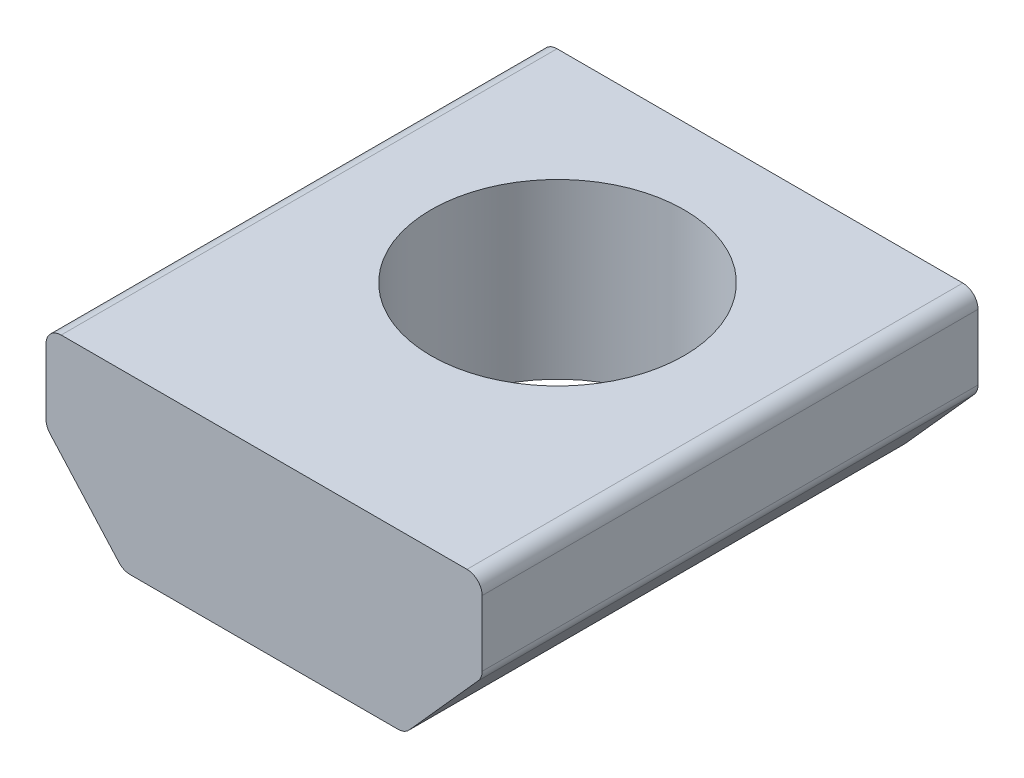
ISO-10303-21;
HEADER;
FILE_DESCRIPTION(('STEP AP214'),'2;1');
FILE_NAME('part.step','',(''),(''),'','','');
FILE_SCHEMA(('AUTOMOTIVE_DESIGN { 1 0 10303 214 1 1 1 1 }'));
ENDSEC;
DATA;
#1=APPLICATION_CONTEXT('core data for automotive mechanical design processes');
#2=APPLICATION_PROTOCOL_DEFINITION('international standard','automotive_design',2000,#1);
#3=PRODUCT_CONTEXT('',#1,'mechanical');
#4=PRODUCT('Part','Part','',(#3));
#5=PRODUCT_RELATED_PRODUCT_CATEGORY('part','',(#4));
#6=PRODUCT_DEFINITION_FORMATION('','',#4);
#7=PRODUCT_DEFINITION_CONTEXT('part definition',#1,'design');
#8=PRODUCT_DEFINITION('design','',#6,#7);
#9=PRODUCT_DEFINITION_SHAPE('','',#8);
#10=(LENGTH_UNIT() NAMED_UNIT(*) SI_UNIT(.MILLI.,.METRE.));
#11=(NAMED_UNIT(*) PLANE_ANGLE_UNIT() SI_UNIT($,.RADIAN.));
#12=(NAMED_UNIT(*) SI_UNIT($,.STERADIAN.) SOLID_ANGLE_UNIT());
#13=UNCERTAINTY_MEASURE_WITH_UNIT(LENGTH_MEASURE(1.E-05),#10,'distance_accuracy_value','');
#14=(GEOMETRIC_REPRESENTATION_CONTEXT(3) GLOBAL_UNCERTAINTY_ASSIGNED_CONTEXT((#13)) GLOBAL_UNIT_ASSIGNED_CONTEXT((#10,
#11,#12)) REPRESENTATION_CONTEXT('',''));
#15=CARTESIAN_POINT('',(0.,0.,0.));
#16=DIRECTION('',(0.,0.,1.));
#17=DIRECTION('',(1.,0.,0.));
#18=AXIS2_PLACEMENT_3D('',#15,#16,#17);
#19=CARTESIAN_POINT('',(5.09269999999992,-2.02613340156511,12.446));
#20=DIRECTION('',(0.,0.,-1.));
#21=DIRECTION('',(-1.,0.,0.));
#22=AXIS2_PLACEMENT_3D('',#19,#20,#21);
#23=CYLINDRICAL_SURFACE('',#22,0.381000000000009);
#24=CARTESIAN_POINT('',(5.09269999999992,-2.02613340156511,0.));
#25=DIRECTION('',(0.,0.,1.));
#26=DIRECTION('',(1.,0.,0.));
#27=AXIS2_PLACEMENT_3D('',#24,#25,#26);
#28=CIRCLE('',#27,0.381000000000009);
#29=CARTESIAN_POINT('',(5.37663694045301,-2.28018224302311,0.));
#30=VERTEX_POINT('',#29);
#31=CARTESIAN_POINT('',(5.47369999999993,-2.02613340156511,0.));
#32=VERTEX_POINT('',#31);
#33=EDGE_CURVE('E156',#30,#32,#28,.T.);
#34=ORIENTED_EDGE('',*,*,#33,.T.);
#35=DIRECTION('',(0.,0.,-1.));
#36=VECTOR('',#35,1.);
#37=CARTESIAN_POINT('',(5.47369999999993,-2.02613340156511,12.446));
#38=LINE('',#37,#36);
#39=CARTESIAN_POINT('',(5.47369999999993,-2.02613340156511,12.446));
#40=VERTEX_POINT('',#39);
#41=EDGE_CURVE('E11',#40,#32,#38,.T.);
#42=ORIENTED_EDGE('',*,*,#41,.F.);
#43=CARTESIAN_POINT('',(5.09269999999992,-2.02613340156511,12.446));
#44=DIRECTION('',(0.,0.,1.));
#45=DIRECTION('',(1.,0.,0.));
#46=AXIS2_PLACEMENT_3D('',#43,#44,#45);
#47=CIRCLE('',#46,0.381000000000009);
#48=CARTESIAN_POINT('',(5.37663694045301,-2.28018224302311,12.446));
#49=VERTEX_POINT('',#48);
#50=EDGE_CURVE('E178',#49,#40,#47,.T.);
#51=ORIENTED_EDGE('',*,*,#50,.F.);
#52=DIRECTION('',(0.,0.,-1.));
#53=VECTOR('',#52,1.);
#54=CARTESIAN_POINT('',(5.37663694045301,-2.28018224302311,12.446));
#55=LINE('',#54,#53);
#56=EDGE_CURVE('E152',#49,#30,#55,.T.);
#57=ORIENTED_EDGE('',*,*,#56,.T.);
#58=EDGE_LOOP('',(#34,#42,#51,#57));
#59=FACE_BOUND('',#58,.T.);
#60=ADVANCED_FACE('F35',(#59),#23,.T.);
#61=CARTESIAN_POINT('',(5.47369999999993,-0.38100000000002,12.446));
#62=DIRECTION('',(-1.,0.,0.));
#63=DIRECTION('',(0.,0.,1.));
#64=AXIS2_PLACEMENT_3D('',#61,#62,#63);
#65=PLANE('',#64);
#66=DIRECTION('',(0.,1.,0.));
#67=VECTOR('',#66,1.);
#68=CARTESIAN_POINT('',(5.47369999999993,-0.38100000000002,0.));
#69=LINE('',#68,#67);
#70=CARTESIAN_POINT('',(5.47369999999993,-0.38100000000002,0.));
#71=VERTEX_POINT('',#70);
#72=EDGE_CURVE('E159',#32,#71,#69,.T.);
#73=ORIENTED_EDGE('',*,*,#72,.T.);
#74=DIRECTION('',(0.,0.,-1.));
#75=VECTOR('',#74,1.);
#76=CARTESIAN_POINT('',(5.47369999999993,-0.38100000000002,12.446));
#77=LINE('',#76,#75);
#78=CARTESIAN_POINT('',(5.47369999999993,-0.38100000000002,12.446));
#79=VERTEX_POINT('',#78);
#80=EDGE_CURVE('E44',#79,#71,#77,.T.);
#81=ORIENTED_EDGE('',*,*,#80,.F.);
#82=DIRECTION('',(0.,1.,0.));
#83=VECTOR('',#82,1.);
#84=CARTESIAN_POINT('',(5.47369999999993,-0.38100000000002,12.446));
#85=LINE('',#84,#83);
#86=EDGE_CURVE('E107',#40,#79,#85,.T.);
#87=ORIENTED_EDGE('',*,*,#86,.F.);
#88=ORIENTED_EDGE('',*,*,#41,.T.);
#89=EDGE_LOOP('',(#73,#81,#87,#88));
#90=FACE_BOUND('',#89,.T.);
#91=ADVANCED_FACE('F257',(#90),#65,.F.);
#92=CARTESIAN_POINT('',(5.09269999999991,-0.38100000000002,12.446));
#93=DIRECTION('',(0.,0.,-1.));
#94=DIRECTION('',(-1.,0.,0.));
#95=AXIS2_PLACEMENT_3D('',#92,#93,#94);
#96=CYLINDRICAL_SURFACE('',#95,0.38100000000002);
#97=CARTESIAN_POINT('',(5.09269999999991,-0.38100000000002,0.));
#98=DIRECTION('',(0.,0.,1.));
#99=DIRECTION('',(1.,0.,0.));
#100=AXIS2_PLACEMENT_3D('',#97,#98,#99);
#101=CIRCLE('',#100,0.38100000000002);
#102=CARTESIAN_POINT('',(5.09269999999998,0.,0.));
#103=VERTEX_POINT('',#102);
#104=EDGE_CURVE('E161',#71,#103,#101,.T.);
#105=ORIENTED_EDGE('',*,*,#104,.T.);
#106=DIRECTION('',(0.,0.,-1.));
#107=VECTOR('',#106,1.);
#108=CARTESIAN_POINT('',(5.09269999999998,0.,12.446));
#109=LINE('',#108,#107);
#110=CARTESIAN_POINT('',(5.09269999999998,0.,12.446));
#111=VERTEX_POINT('',#110);
#112=EDGE_CURVE('E197',#111,#103,#109,.T.);
#113=ORIENTED_EDGE('',*,*,#112,.F.);
#114=CARTESIAN_POINT('',(5.09269999999991,-0.38100000000002,12.446));
#115=DIRECTION('',(0.,0.,1.));
#116=DIRECTION('',(1.,0.,0.));
#117=AXIS2_PLACEMENT_3D('',#114,#115,#116);
#118=CIRCLE('',#117,0.38100000000002);
#119=EDGE_CURVE('E206',#79,#111,#118,.T.);
#120=ORIENTED_EDGE('',*,*,#119,.F.);
#121=ORIENTED_EDGE('',*,*,#80,.T.);
#122=EDGE_LOOP('',(#105,#113,#120,#121));
#123=FACE_BOUND('',#122,.T.);
#124=ADVANCED_FACE('F204',(#123),#96,.T.);
#125=CARTESIAN_POINT('',(-5.09269999999998,0.,12.446));
#126=DIRECTION('',(0.,-1.,0.));
#127=DIRECTION('',(0.,0.,-1.));
#128=AXIS2_PLACEMENT_3D('',#125,#126,#127);
#129=PLANE('',#128);
#130=CARTESIAN_POINT('',(0.,0.,5.08));
#131=DIRECTION('',(0.,1.,0.));
#132=DIRECTION('',(-1.,0.,0.));
#133=AXIS2_PLACEMENT_3D('',#130,#131,#132);
#134=CIRCLE('',#133,3.175);
#135=CARTESIAN_POINT('',(-3.175,0.,5.08));
#136=VERTEX_POINT('',#135);
#137=EDGE_CURVE('E290',#136,#136,#134,.T.);
#138=ORIENTED_EDGE('',*,*,#137,.F.);
#139=EDGE_LOOP('',(#138));
#140=FACE_BOUND('',#139,.T.);
#141=DIRECTION('',(-1.,0.,0.));
#142=VECTOR('',#141,1.);
#143=CARTESIAN_POINT('',(-5.09269999999998,0.,0.));
#144=LINE('',#143,#142);
#145=CARTESIAN_POINT('',(-5.09269999999998,0.,0.));
#146=VERTEX_POINT('',#145);
#147=EDGE_CURVE('E163',#103,#146,#144,.T.);
#148=ORIENTED_EDGE('',*,*,#147,.T.);
#149=DIRECTION('',(0.,0.,-1.));
#150=VECTOR('',#149,1.);
#151=CARTESIAN_POINT('',(-5.09269999999998,0.,12.446));
#152=LINE('',#151,#150);
#153=CARTESIAN_POINT('',(-5.09269999999998,0.,12.446));
#154=VERTEX_POINT('',#153);
#155=EDGE_CURVE('E194',#154,#146,#152,.T.);
#156=ORIENTED_EDGE('',*,*,#155,.F.);
#157=DIRECTION('',(-1.,0.,0.));
#158=VECTOR('',#157,1.);
#159=CARTESIAN_POINT('',(-5.09269999999998,0.,12.446));
#160=LINE('',#159,#158);
#161=EDGE_CURVE('E224',#111,#154,#160,.T.);
#162=ORIENTED_EDGE('',*,*,#161,.F.);
#163=ORIENTED_EDGE('',*,*,#112,.T.);
#164=EDGE_LOOP('',(#148,#156,#162,#163));
#165=FACE_BOUND('',#164,.T.);
#166=ADVANCED_FACE('F215',(#140,#165),#129,.F.);
#167=CARTESIAN_POINT('',(-5.09269999999998,-0.381000000000006,12.446));
#168=DIRECTION('',(0.,0.,-1.));
#169=DIRECTION('',(-1.,0.,0.));
#170=AXIS2_PLACEMENT_3D('',#167,#168,#169);
#171=CYLINDRICAL_SURFACE('',#170,0.381000000000013);
#172=CARTESIAN_POINT('',(-5.09269999999998,-0.381000000000006,0.));
#173=DIRECTION('',(0.,0.,1.));
#174=DIRECTION('',(1.,0.,0.));
#175=AXIS2_PLACEMENT_3D('',#172,#173,#174);
#176=CIRCLE('',#175,0.381000000000013);
#177=CARTESIAN_POINT('',(-5.47369999999999,-0.381000000000006,0.));
#178=VERTEX_POINT('',#177);
#179=EDGE_CURVE('E165',#146,#178,#176,.T.);
#180=ORIENTED_EDGE('',*,*,#179,.T.);
#181=DIRECTION('',(0.,0.,-1.));
#182=VECTOR('',#181,1.);
#183=CARTESIAN_POINT('',(-5.47369999999999,-0.381000000000006,12.446));
#184=LINE('',#183,#182);
#185=CARTESIAN_POINT('',(-5.47369999999999,-0.381000000000006,12.446));
#186=VERTEX_POINT('',#185);
#187=EDGE_CURVE('E191',#186,#178,#184,.T.);
#188=ORIENTED_EDGE('',*,*,#187,.F.);
#189=CARTESIAN_POINT('',(-5.09269999999998,-0.381000000000006,12.446));
#190=DIRECTION('',(0.,0.,1.));
#191=DIRECTION('',(1.,0.,0.));
#192=AXIS2_PLACEMENT_3D('',#189,#190,#191);
#193=CIRCLE('',#192,0.381000000000013);
#194=EDGE_CURVE('E221',#154,#186,#193,.T.);
#195=ORIENTED_EDGE('',*,*,#194,.F.);
#196=ORIENTED_EDGE('',*,*,#155,.T.);
#197=EDGE_LOOP('',(#180,#188,#195,#196));
#198=FACE_BOUND('',#197,.T.);
#199=ADVANCED_FACE('F219',(#198),#171,.T.);
#200=CARTESIAN_POINT('',(-5.4737,-0.381000000000006,12.446));
#201=DIRECTION('',(1.,0.,0.));
#202=DIRECTION('',(0.,0.,-1.));
#203=AXIS2_PLACEMENT_3D('',#200,#201,#202);
#204=PLANE('',#203);
#205=DIRECTION('',(0.,-1.,0.));
#206=VECTOR('',#205,1.);
#207=CARTESIAN_POINT('',(-5.4737,-0.381000000000006,0.));
#208=LINE('',#207,#206);
#209=CARTESIAN_POINT('',(-5.4737,-2.0261334015651,0.));
#210=VERTEX_POINT('',#209);
#211=EDGE_CURVE('E167',#178,#210,#208,.T.);
#212=ORIENTED_EDGE('',*,*,#211,.T.);
#213=DIRECTION('',(0.,0.,-1.));
#214=VECTOR('',#213,1.);
#215=CARTESIAN_POINT('',(-5.4737,-2.0261334015651,12.446));
#216=LINE('',#215,#214);
#217=CARTESIAN_POINT('',(-5.4737,-2.0261334015651,12.446));
#218=VERTEX_POINT('',#217);
#219=EDGE_CURVE('E188',#218,#210,#216,.T.);
#220=ORIENTED_EDGE('',*,*,#219,.F.);
#221=DIRECTION('',(0.,-1.,0.));
#222=VECTOR('',#221,1.);
#223=CARTESIAN_POINT('',(-5.4737,-0.381000000000006,12.446));
#224=LINE('',#223,#222);
#225=EDGE_CURVE('E223',#186,#218,#224,.T.);
#226=ORIENTED_EDGE('',*,*,#225,.F.);
#227=ORIENTED_EDGE('',*,*,#187,.T.);
#228=EDGE_LOOP('',(#212,#220,#226,#227));
#229=FACE_BOUND('',#228,.T.);
#230=ADVANCED_FACE('F271',(#229),#204,.F.);
#231=CARTESIAN_POINT('',(-5.09269999999999,-2.0261334015651,12.446));
#232=DIRECTION('',(0.,0.,-1.));
#233=DIRECTION('',(-1.,0.,0.));
#234=AXIS2_PLACEMENT_3D('',#231,#232,#233);
#235=CYLINDRICAL_SURFACE('',#234,0.381000000000004);
#236=CARTESIAN_POINT('',(-5.09269999999999,-2.0261334015651,0.));
#237=DIRECTION('',(0.,0.,1.));
#238=DIRECTION('',(1.,0.,0.));
#239=AXIS2_PLACEMENT_3D('',#236,#237,#238);
#240=CIRCLE('',#239,0.381000000000004);
#241=CARTESIAN_POINT('',(-5.37663694045307,-2.28018224302309,0.));
#242=VERTEX_POINT('',#241);
#243=EDGE_CURVE('E169',#210,#242,#240,.T.);
#244=ORIENTED_EDGE('',*,*,#243,.T.);
#245=DIRECTION('',(0.,0.,-1.));
#246=VECTOR('',#245,1.);
#247=CARTESIAN_POINT('',(-5.37663694045307,-2.28018224302309,12.446));
#248=LINE('',#247,#246);
#249=CARTESIAN_POINT('',(-5.37663694045307,-2.28018224302309,12.446));
#250=VERTEX_POINT('',#249);
#251=EDGE_CURVE('E185',#250,#242,#248,.T.);
#252=ORIENTED_EDGE('',*,*,#251,.F.);
#253=CARTESIAN_POINT('',(-5.09269999999999,-2.0261334015651,12.446));
#254=DIRECTION('',(0.,0.,1.));
#255=DIRECTION('',(1.,0.,0.));
#256=AXIS2_PLACEMENT_3D('',#253,#254,#255);
#257=CIRCLE('',#256,0.381000000000004);
#258=EDGE_CURVE('E226',#218,#250,#257,.T.);
#259=ORIENTED_EDGE('',*,*,#258,.F.);
#260=ORIENTED_EDGE('',*,*,#219,.T.);
#261=EDGE_LOOP('',(#244,#252,#259,#260));
#262=FACE_BOUND('',#261,.T.);
#263=ADVANCED_FACE('F274',(#262),#235,.T.);
#264=CARTESIAN_POINT('',(-3.64418787869555,-4.21644884145803,12.446));
#265=DIRECTION('',(0.74524131352511,0.666794859469813,0.));
#266=DIRECTION('',(-0.666794859469813,0.745241313525111,0.));
#267=AXIS2_PLACEMENT_3D('',#264,#265,#266);
#268=PLANE('',#267);
#269=DIRECTION('',(0.666794859469813,-0.745241313525111,0.));
#270=VECTOR('',#269,1.);
#271=CARTESIAN_POINT('',(-3.64418787869555,-4.21644884145803,0.));
#272=LINE('',#271,#270);
#273=CARTESIAN_POINT('',(-3.64418787869555,-4.21644884145803,0.));
#274=VERTEX_POINT('',#273);
#275=EDGE_CURVE('E171',#242,#274,#272,.T.);
#276=ORIENTED_EDGE('',*,*,#275,.T.);
#277=DIRECTION('',(0.,0.,-1.));
#278=VECTOR('',#277,1.);
#279=CARTESIAN_POINT('',(-3.64418787869555,-4.21644884145803,12.446));
#280=LINE('',#279,#278);
#281=CARTESIAN_POINT('',(-3.64418787869555,-4.21644884145803,12.446));
#282=VERTEX_POINT('',#281);
#283=EDGE_CURVE('E182',#282,#274,#280,.T.);
#284=ORIENTED_EDGE('',*,*,#283,.F.);
#285=DIRECTION('',(0.666794859469813,-0.745241313525111,0.));
#286=VECTOR('',#285,1.);
#287=CARTESIAN_POINT('',(-3.64418787869555,-4.21644884145803,12.446));
#288=LINE('',#287,#286);
#289=EDGE_CURVE('E232',#250,#282,#288,.T.);
#290=ORIENTED_EDGE('',*,*,#289,.F.);
#291=ORIENTED_EDGE('',*,*,#251,.T.);
#292=EDGE_LOOP('',(#276,#284,#290,#291));
#293=FACE_BOUND('',#292,.T.);
#294=ADVANCED_FACE('F238',(#293),#268,.F.);
#295=CARTESIAN_POINT('',(-3.36025093824249,-3.96240000000005,12.446));
#296=DIRECTION('',(0.,0.,-1.));
#297=DIRECTION('',(-1.,0.,0.));
#298=AXIS2_PLACEMENT_3D('',#295,#296,#297);
#299=CYLINDRICAL_SURFACE('',#298,0.380999999999981);
#300=CARTESIAN_POINT('',(-3.36025093824249,-3.96240000000005,0.));
#301=DIRECTION('',(0.,0.,1.));
#302=DIRECTION('',(1.,0.,0.));
#303=AXIS2_PLACEMENT_3D('',#300,#301,#302);
#304=CIRCLE('',#303,0.380999999999981);
#305=CARTESIAN_POINT('',(-3.36025093824249,-4.34340000000003,0.));
#306=VERTEX_POINT('',#305);
#307=EDGE_CURVE('E173',#274,#306,#304,.T.);
#308=ORIENTED_EDGE('',*,*,#307,.T.);
#309=DIRECTION('',(0.,0.,-1.));
#310=VECTOR('',#309,1.);
#311=CARTESIAN_POINT('',(-3.36025093824249,-4.34340000000003,12.446));
#312=LINE('',#311,#310);
#313=CARTESIAN_POINT('',(-3.36025093824249,-4.34340000000003,12.446));
#314=VERTEX_POINT('',#313);
#315=EDGE_CURVE('E147',#314,#306,#312,.T.);
#316=ORIENTED_EDGE('',*,*,#315,.F.);
#317=CARTESIAN_POINT('',(-3.36025093824249,-3.96240000000005,12.446));
#318=DIRECTION('',(0.,0.,1.));
#319=DIRECTION('',(1.,0.,0.));
#320=AXIS2_PLACEMENT_3D('',#317,#318,#319);
#321=CIRCLE('',#320,0.380999999999981);
#322=EDGE_CURVE('E138',#282,#314,#321,.T.);
#323=ORIENTED_EDGE('',*,*,#322,.F.);
#324=ORIENTED_EDGE('',*,*,#283,.T.);
#325=EDGE_LOOP('',(#308,#316,#323,#324));
#326=FACE_BOUND('',#325,.T.);
#327=ADVANCED_FACE('F242',(#326),#299,.T.);
#328=CARTESIAN_POINT('',(-3.36025093824249,-4.34340000000002,12.446));
#329=DIRECTION('',(0.,1.,0.));
#330=DIRECTION('',(0.,0.,1.));
#331=AXIS2_PLACEMENT_3D('',#328,#329,#330);
#332=PLANE('',#331);
#333=CARTESIAN_POINT('',(0.,-4.34340000000002,5.08));
#334=DIRECTION('',(0.,1.,0.));
#335=DIRECTION('',(0.,0.,1.));
#336=AXIS2_PLACEMENT_3D('',#333,#334,#335);
#337=CIRCLE('',#336,3.175);
#338=CARTESIAN_POINT('',(0.,-4.34340000000002,8.255));
#339=VERTEX_POINT('',#338);
#340=EDGE_CURVE('E38',#339,#339,#337,.T.);
#341=ORIENTED_EDGE('',*,*,#340,.T.);
#342=EDGE_LOOP('',(#341));
#343=FACE_BOUND('',#342,.T.);
#344=DIRECTION('',(1.,0.,0.));
#345=VECTOR('',#344,1.);
#346=CARTESIAN_POINT('',(-3.36025093824249,-4.34340000000002,0.));
#347=LINE('',#346,#345);
#348=CARTESIAN_POINT('',(3.36025093824238,-4.34340000000002,0.));
#349=VERTEX_POINT('',#348);
#350=EDGE_CURVE('E146',#306,#349,#347,.T.);
#351=ORIENTED_EDGE('',*,*,#350,.T.);
#352=DIRECTION('',(0.,0.,-1.));
#353=VECTOR('',#352,1.);
#354=CARTESIAN_POINT('',(3.36025093824238,-4.34340000000002,12.446));
#355=LINE('',#354,#353);
#356=CARTESIAN_POINT('',(3.36025093824238,-4.34340000000002,12.446));
#357=VERTEX_POINT('',#356);
#358=EDGE_CURVE('E143',#357,#349,#355,.T.);
#359=ORIENTED_EDGE('',*,*,#358,.F.);
#360=DIRECTION('',(1.,0.,0.));
#361=VECTOR('',#360,1.);
#362=CARTESIAN_POINT('',(-3.36025093824249,-4.34340000000002,12.446));
#363=LINE('',#362,#361);
#364=EDGE_CURVE('E132',#314,#357,#363,.T.);
#365=ORIENTED_EDGE('',*,*,#364,.F.);
#366=ORIENTED_EDGE('',*,*,#315,.T.);
#367=EDGE_LOOP('',(#351,#359,#365,#366));
#368=FACE_BOUND('',#367,.T.);
#369=ADVANCED_FACE('F144',(#343,#368),#332,.F.);
#370=CARTESIAN_POINT('',(3.36025093824238,-3.96240000000003,12.446));
#371=DIRECTION('',(0.,0.,-1.));
#372=DIRECTION('',(-1.,0.,0.));
#373=AXIS2_PLACEMENT_3D('',#370,#371,#372);
#374=CYLINDRICAL_SURFACE('',#373,0.380999999999993);
#375=CARTESIAN_POINT('',(3.36025093824238,-3.96240000000003,0.));
#376=DIRECTION('',(0.,0.,1.));
#377=DIRECTION('',(1.,0.,0.));
#378=AXIS2_PLACEMENT_3D('',#375,#376,#377);
#379=CIRCLE('',#378,0.380999999999993);
#380=CARTESIAN_POINT('',(3.64418787869546,-4.21644884145801,0.));
#381=VERTEX_POINT('',#380);
#382=EDGE_CURVE('E93',#349,#381,#379,.T.);
#383=ORIENTED_EDGE('',*,*,#382,.T.);
#384=DIRECTION('',(0.,0.,-1.));
#385=VECTOR('',#384,1.);
#386=CARTESIAN_POINT('',(3.64418787869546,-4.21644884145801,12.446));
#387=LINE('',#386,#385);
#388=CARTESIAN_POINT('',(3.64418787869546,-4.21644884145801,12.446));
#389=VERTEX_POINT('',#388);
#390=EDGE_CURVE('E148',#389,#381,#387,.T.);
#391=ORIENTED_EDGE('',*,*,#390,.F.);
#392=CARTESIAN_POINT('',(3.36025093824238,-3.96240000000003,12.446));
#393=DIRECTION('',(0.,0.,1.));
#394=DIRECTION('',(1.,0.,0.));
#395=AXIS2_PLACEMENT_3D('',#392,#393,#394);
#396=CIRCLE('',#395,0.380999999999993);
#397=EDGE_CURVE('E136',#357,#389,#396,.T.);
#398=ORIENTED_EDGE('',*,*,#397,.F.);
#399=ORIENTED_EDGE('',*,*,#358,.T.);
#400=EDGE_LOOP('',(#383,#391,#398,#399));
#401=FACE_BOUND('',#400,.T.);
#402=ADVANCED_FACE('F150',(#401),#374,.T.);
#403=CARTESIAN_POINT('',(3.64418787869546,-4.21644884145801,12.446));
#404=DIRECTION('',(-0.745241313525098,0.666794859469827,0.));
#405=DIRECTION('',(-0.666794859469828,-0.745241313525098,0.));
#406=AXIS2_PLACEMENT_3D('',#403,#404,#405);
#407=PLANE('',#406);
#408=DIRECTION('',(0.666794859469828,0.745241313525098,0.));
#409=VECTOR('',#408,1.);
#410=CARTESIAN_POINT('',(3.64418787869546,-4.21644884145801,0.));
#411=LINE('',#410,#409);
#412=EDGE_CURVE('E99',#381,#30,#411,.T.);
#413=ORIENTED_EDGE('',*,*,#412,.T.);
#414=ORIENTED_EDGE('',*,*,#56,.F.);
#415=DIRECTION('',(0.666794859469828,0.745241313525098,0.));
#416=VECTOR('',#415,1.);
#417=CARTESIAN_POINT('',(3.64418787869546,-4.21644884145801,12.446));
#418=LINE('',#417,#416);
#419=EDGE_CURVE('E52',#389,#49,#418,.T.);
#420=ORIENTED_EDGE('',*,*,#419,.F.);
#421=ORIENTED_EDGE('',*,*,#390,.T.);
#422=EDGE_LOOP('',(#413,#414,#420,#421));
#423=FACE_BOUND('',#422,.T.);
#424=ADVANCED_FACE('F246',(#423),#407,.F.);
#425=CARTESIAN_POINT('',(5.09269999999992,-2.02613340156511,12.446));
#426=DIRECTION('',(0.,0.,1.));
#427=DIRECTION('',(1.,0.,0.));
#428=AXIS2_PLACEMENT_3D('',#425,#426,#427);
#429=PLANE('',#428);
#430=ORIENTED_EDGE('',*,*,#50,.T.);
#431=ORIENTED_EDGE('',*,*,#86,.T.);
#432=ORIENTED_EDGE('',*,*,#119,.T.);
#433=ORIENTED_EDGE('',*,*,#161,.T.);
#434=ORIENTED_EDGE('',*,*,#194,.T.);
#435=ORIENTED_EDGE('',*,*,#225,.T.);
#436=ORIENTED_EDGE('',*,*,#258,.T.);
#437=ORIENTED_EDGE('',*,*,#289,.T.);
#438=ORIENTED_EDGE('',*,*,#322,.T.);
#439=ORIENTED_EDGE('',*,*,#364,.T.);
#440=ORIENTED_EDGE('',*,*,#397,.T.);
#441=ORIENTED_EDGE('',*,*,#419,.T.);
#442=EDGE_LOOP('',(#430,#431,#432,#433,#434,#435,#436,#437,#438,#439,#440,#441));
#443=FACE_BOUND('',#442,.T.);
#444=ADVANCED_FACE('F134',(#443),#429,.T.);
#445=CARTESIAN_POINT('',(5.09269999999992,-2.02613340156511,0.));
#446=DIRECTION('',(0.,0.,1.));
#447=DIRECTION('',(1.,0.,0.));
#448=AXIS2_PLACEMENT_3D('',#445,#446,#447);
#449=PLANE('',#448);
#450=ORIENTED_EDGE('',*,*,#33,.F.);
#451=ORIENTED_EDGE('',*,*,#412,.F.);
#452=ORIENTED_EDGE('',*,*,#382,.F.);
#453=ORIENTED_EDGE('',*,*,#350,.F.);
#454=ORIENTED_EDGE('',*,*,#307,.F.);
#455=ORIENTED_EDGE('',*,*,#275,.F.);
#456=ORIENTED_EDGE('',*,*,#243,.F.);
#457=ORIENTED_EDGE('',*,*,#211,.F.);
#458=ORIENTED_EDGE('',*,*,#179,.F.);
#459=ORIENTED_EDGE('',*,*,#147,.F.);
#460=ORIENTED_EDGE('',*,*,#104,.F.);
#461=ORIENTED_EDGE('',*,*,#72,.F.);
#462=EDGE_LOOP('',(#450,#451,#452,#453,#454,#455,#456,#457,#458,#459,#460,#461));
#463=FACE_BOUND('',#462,.T.);
#464=ADVANCED_FACE('F210',(#463),#449,.F.);
#465=CARTESIAN_POINT('',(0.,-12.446,5.08));
#466=DIRECTION('',(0.,1.,0.));
#467=DIRECTION('',(-1.,0.,0.));
#468=AXIS2_PLACEMENT_3D('',#465,#466,#467);
#469=CYLINDRICAL_SURFACE('',#468,3.175);
#470=ORIENTED_EDGE('',*,*,#137,.T.);
#471=EDGE_LOOP('',(#470));
#472=FACE_BOUND('',#471,.T.);
#473=ORIENTED_EDGE('',*,*,#340,.F.);
#474=EDGE_LOOP('',(#473));
#475=FACE_BOUND('',#474,.T.);
#476=ADVANCED_FACE('F297',(#472,#475),#469,.F.);
#477=CLOSED_SHELL('',(#60,#91,#124,#166,#199,#230,#263,#294,#327,#369,#402,#424,#444,#464,#476));
#478=MANIFOLD_SOLID_BREP('B2',#477);
#479=ADVANCED_BREP_SHAPE_REPRESENTATION('',(#18,#478),#14);
#480=SHAPE_DEFINITION_REPRESENTATION(#9,#479);
ENDSEC;
END-ISO-10303-21;
